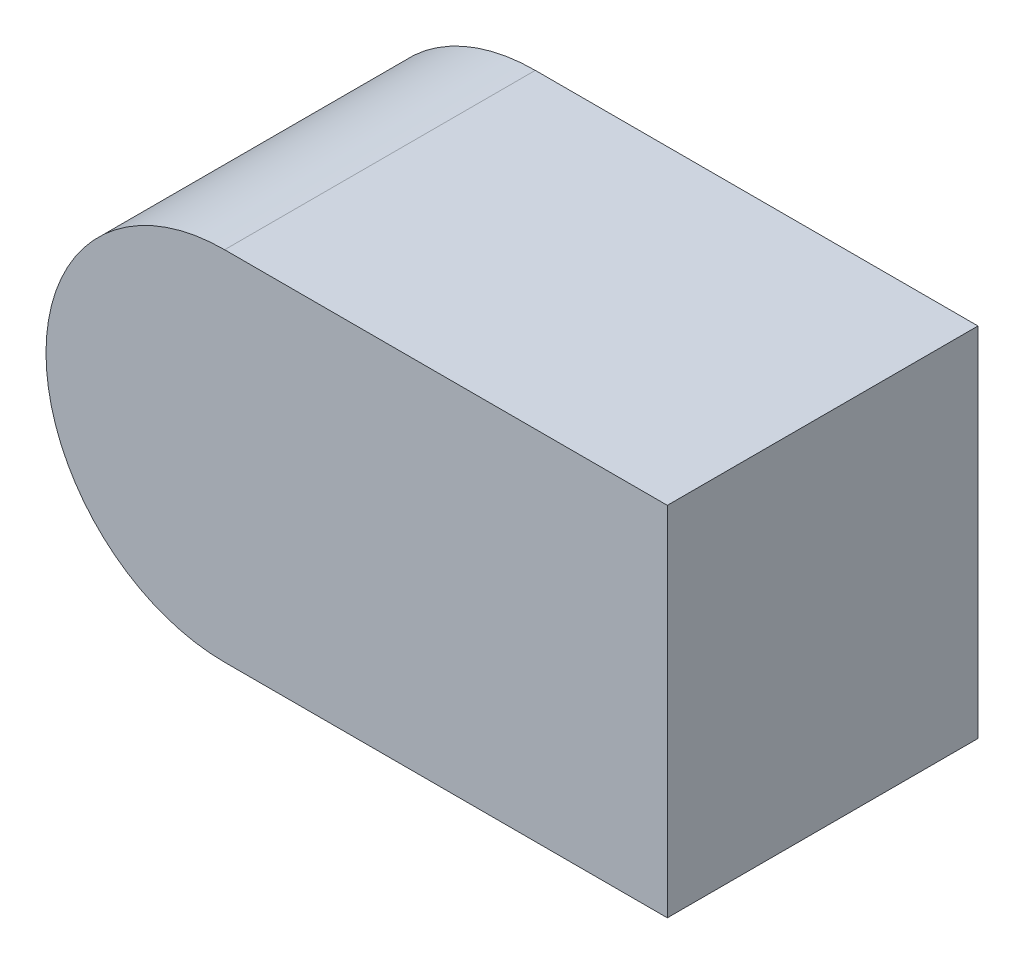
ISO-10303-21;
HEADER;
FILE_DESCRIPTION(('STEP AP214'),'2;1');
FILE_NAME('part.step','',(''),(''),'','','');
FILE_SCHEMA(('AUTOMOTIVE_DESIGN { 1 0 10303 214 1 1 1 1 }'));
ENDSEC;
DATA;
#1=APPLICATION_CONTEXT('core data for automotive mechanical design processes');
#2=APPLICATION_PROTOCOL_DEFINITION('international standard','automotive_design',2000,#1);
#3=PRODUCT_CONTEXT('',#1,'mechanical');
#4=PRODUCT('Part','Part','',(#3));
#5=PRODUCT_RELATED_PRODUCT_CATEGORY('part','',(#4));
#6=PRODUCT_DEFINITION_FORMATION('','',#4);
#7=PRODUCT_DEFINITION_CONTEXT('part definition',#1,'design');
#8=PRODUCT_DEFINITION('design','',#6,#7);
#9=PRODUCT_DEFINITION_SHAPE('','',#8);
#10=(LENGTH_UNIT() NAMED_UNIT(*) SI_UNIT(.MILLI.,.METRE.));
#11=(NAMED_UNIT(*) PLANE_ANGLE_UNIT() SI_UNIT($,.RADIAN.));
#12=(NAMED_UNIT(*) SI_UNIT($,.STERADIAN.) SOLID_ANGLE_UNIT());
#13=UNCERTAINTY_MEASURE_WITH_UNIT(LENGTH_MEASURE(1.E-05),#10,'distance_accuracy_value','');
#14=(GEOMETRIC_REPRESENTATION_CONTEXT(3) GLOBAL_UNCERTAINTY_ASSIGNED_CONTEXT((#13)) GLOBAL_UNIT_ASSIGNED_CONTEXT((#10,
#11,#12)) REPRESENTATION_CONTEXT('',''));
#15=CARTESIAN_POINT('',(0.,0.,0.));
#16=DIRECTION('',(0.,0.,1.));
#17=DIRECTION('',(1.,0.,0.));
#18=AXIS2_PLACEMENT_3D('',#15,#16,#17);
#19=CARTESIAN_POINT('',(2.8335240809167,1.25,0.2));
#20=DIRECTION('',(0.,0.,1.));
#21=DIRECTION('',(1.,0.,0.));
#22=AXIS2_PLACEMENT_3D('',#19,#20,#21);
#23=PLANE('',#22);
#24=DIRECTION('',(1.,0.,0.));
#25=VECTOR('',#24,1.);
#26=CARTESIAN_POINT('',(2.715,1.135,0.2));
#27=LINE('',#26,#25);
#28=CARTESIAN_POINT('',(2.715,1.135,0.2));
#29=VERTEX_POINT('',#28);
#30=CARTESIAN_POINT('',(3.,1.135,0.2));
#31=VERTEX_POINT('',#30);
#32=EDGE_CURVE('E11',#29,#31,#27,.T.);
#33=ORIENTED_EDGE('',*,*,#32,.T.);
#34=DIRECTION('',(0.,1.,0.));
#35=VECTOR('',#34,1.);
#36=CARTESIAN_POINT('',(3.,-0.875,0.2));
#37=LINE('',#36,#35);
#38=CARTESIAN_POINT('',(3.,1.365,0.2));
#39=VERTEX_POINT('',#38);
#40=EDGE_CURVE('E24',#31,#39,#37,.T.);
#41=ORIENTED_EDGE('',*,*,#40,.T.);
#42=DIRECTION('',(-1.,0.,0.));
#43=VECTOR('',#42,1.);
#44=CARTESIAN_POINT('',(3.,1.365,0.2));
#45=LINE('',#44,#43);
#46=CARTESIAN_POINT('',(2.715,1.365,0.2));
#47=VERTEX_POINT('',#46);
#48=EDGE_CURVE('E88',#39,#47,#45,.T.);
#49=ORIENTED_EDGE('',*,*,#48,.T.);
#50=CARTESIAN_POINT('',(2.715,1.25,0.2));
#51=DIRECTION('',(0.,0.,1.));
#52=DIRECTION('',(0.,1.,0.));
#53=AXIS2_PLACEMENT_3D('',#50,#51,#52);
#54=CIRCLE('',#53,0.115);
#55=EDGE_CURVE('E70',#47,#29,#54,.T.);
#56=ORIENTED_EDGE('',*,*,#55,.T.);
#57=EDGE_LOOP('',(#33,#41,#49,#56));
#58=FACE_BOUND('',#57,.T.);
#59=ADVANCED_FACE('F17',(#58),#23,.T.);
#60=CARTESIAN_POINT('',(3.,-3.,0.));
#61=DIRECTION('',(1.,0.,0.));
#62=DIRECTION('',(0.,1.,0.));
#63=AXIS2_PLACEMENT_3D('',#60,#61,#62);
#64=PLANE('',#63);
#65=DIRECTION('',(0.,0.,-1.));
#66=VECTOR('',#65,1.);
#67=CARTESIAN_POINT('',(3.,1.365,0.));
#68=LINE('',#67,#66);
#69=CARTESIAN_POINT('',(3.,1.365,0.));
#70=VERTEX_POINT('',#69);
#71=EDGE_CURVE('E76',#39,#70,#68,.T.);
#72=ORIENTED_EDGE('',*,*,#71,.F.);
#73=ORIENTED_EDGE('',*,*,#40,.F.);
#74=DIRECTION('',(0.,0.,1.));
#75=VECTOR('',#74,1.);
#76=CARTESIAN_POINT('',(3.,1.135,0.));
#77=LINE('',#76,#75);
#78=CARTESIAN_POINT('',(3.,1.135,0.));
#79=VERTEX_POINT('',#78);
#80=EDGE_CURVE('E84',#79,#31,#77,.T.);
#81=ORIENTED_EDGE('',*,*,#80,.F.);
#82=DIRECTION('',(0.,1.,0.));
#83=VECTOR('',#82,1.);
#84=CARTESIAN_POINT('',(3.,1.135,0.));
#85=LINE('',#84,#83);
#86=EDGE_CURVE('E82',#79,#70,#85,.T.);
#87=ORIENTED_EDGE('',*,*,#86,.T.);
#88=EDGE_LOOP('',(#72,#73,#81,#87));
#89=FACE_BOUND('',#88,.T.);
#90=ADVANCED_FACE('F90',(#89),#64,.T.);
#91=CARTESIAN_POINT('',(2.715,1.135,0.));
#92=DIRECTION('',(0.,-1.,0.));
#93=DIRECTION('',(1.,0.,0.));
#94=AXIS2_PLACEMENT_3D('',#91,#92,#93);
#95=PLANE('',#94);
#96=DIRECTION('',(1.,0.,0.));
#97=VECTOR('',#96,1.);
#98=CARTESIAN_POINT('',(2.715,1.135,0.));
#99=LINE('',#98,#97);
#100=CARTESIAN_POINT('',(2.715,1.135,0.));
#101=VERTEX_POINT('',#100);
#102=EDGE_CURVE('E61',#101,#79,#99,.T.);
#103=ORIENTED_EDGE('',*,*,#102,.T.);
#104=ORIENTED_EDGE('',*,*,#80,.T.);
#105=ORIENTED_EDGE('',*,*,#32,.F.);
#106=DIRECTION('',(0.,0.,1.));
#107=VECTOR('',#106,1.);
#108=CARTESIAN_POINT('',(2.715,1.135,0.));
#109=LINE('',#108,#107);
#110=EDGE_CURVE('E64',#101,#29,#109,.T.);
#111=ORIENTED_EDGE('',*,*,#110,.F.);
#112=EDGE_LOOP('',(#103,#104,#105,#111));
#113=FACE_BOUND('',#112,.T.);
#114=ADVANCED_FACE('F91',(#113),#95,.T.);
#115=CARTESIAN_POINT('',(2.715,1.25,0.));
#116=DIRECTION('',(0.,0.,1.));
#117=DIRECTION('',(0.,1.,0.));
#118=AXIS2_PLACEMENT_3D('',#115,#116,#117);
#119=CYLINDRICAL_SURFACE('',#118,0.115);
#120=CARTESIAN_POINT('',(2.715,1.25,0.));
#121=DIRECTION('',(0.,0.,1.));
#122=DIRECTION('',(0.,1.,0.));
#123=AXIS2_PLACEMENT_3D('',#120,#121,#122);
#124=CIRCLE('',#123,0.115);
#125=CARTESIAN_POINT('',(2.715,1.365,0.));
#126=VERTEX_POINT('',#125);
#127=EDGE_CURVE('E54',#126,#101,#124,.T.);
#128=ORIENTED_EDGE('',*,*,#127,.T.);
#129=ORIENTED_EDGE('',*,*,#110,.T.);
#130=ORIENTED_EDGE('',*,*,#55,.F.);
#131=DIRECTION('',(0.,0.,1.));
#132=VECTOR('',#131,1.);
#133=CARTESIAN_POINT('',(2.715,1.365,0.));
#134=LINE('',#133,#132);
#135=EDGE_CURVE('E65',#126,#47,#134,.T.);
#136=ORIENTED_EDGE('',*,*,#135,.F.);
#137=EDGE_LOOP('',(#128,#129,#130,#136));
#138=FACE_BOUND('',#137,.T.);
#139=ADVANCED_FACE('F69',(#138),#119,.T.);
#140=CARTESIAN_POINT('',(3.,1.365,0.));
#141=DIRECTION('',(0.,1.,0.));
#142=DIRECTION('',(-1.,0.,0.));
#143=AXIS2_PLACEMENT_3D('',#140,#141,#142);
#144=PLANE('',#143);
#145=DIRECTION('',(-1.,0.,0.));
#146=VECTOR('',#145,1.);
#147=CARTESIAN_POINT('',(3.,1.365,0.));
#148=LINE('',#147,#146);
#149=EDGE_CURVE('E59',#70,#126,#148,.T.);
#150=ORIENTED_EDGE('',*,*,#149,.T.);
#151=ORIENTED_EDGE('',*,*,#135,.T.);
#152=ORIENTED_EDGE('',*,*,#48,.F.);
#153=ORIENTED_EDGE('',*,*,#71,.T.);
#154=EDGE_LOOP('',(#150,#151,#152,#153));
#155=FACE_BOUND('',#154,.T.);
#156=ADVANCED_FACE('F74',(#155),#144,.T.);
#157=CARTESIAN_POINT('',(2.8335265642716,1.25,0.));
#158=DIRECTION('',(0.,0.,1.));
#159=DIRECTION('',(-1.,0.,0.));
#160=AXIS2_PLACEMENT_3D('',#157,#158,#159);
#161=PLANE('',#160);
#162=ORIENTED_EDGE('',*,*,#86,.F.);
#163=ORIENTED_EDGE('',*,*,#102,.F.);
#164=ORIENTED_EDGE('',*,*,#127,.F.);
#165=ORIENTED_EDGE('',*,*,#149,.F.);
#166=EDGE_LOOP('',(#162,#163,#164,#165));
#167=FACE_BOUND('',#166,.T.);
#168=ADVANCED_FACE('F57',(#167),#161,.F.);
#169=CLOSED_SHELL('',(#59,#90,#114,#139,#156,#168));
#170=MANIFOLD_SOLID_BREP('B1',#169);
#171=ADVANCED_BREP_SHAPE_REPRESENTATION('',(#18,#170),#14);
#172=SHAPE_DEFINITION_REPRESENTATION(#9,#171);
ENDSEC;
END-ISO-10303-21;
